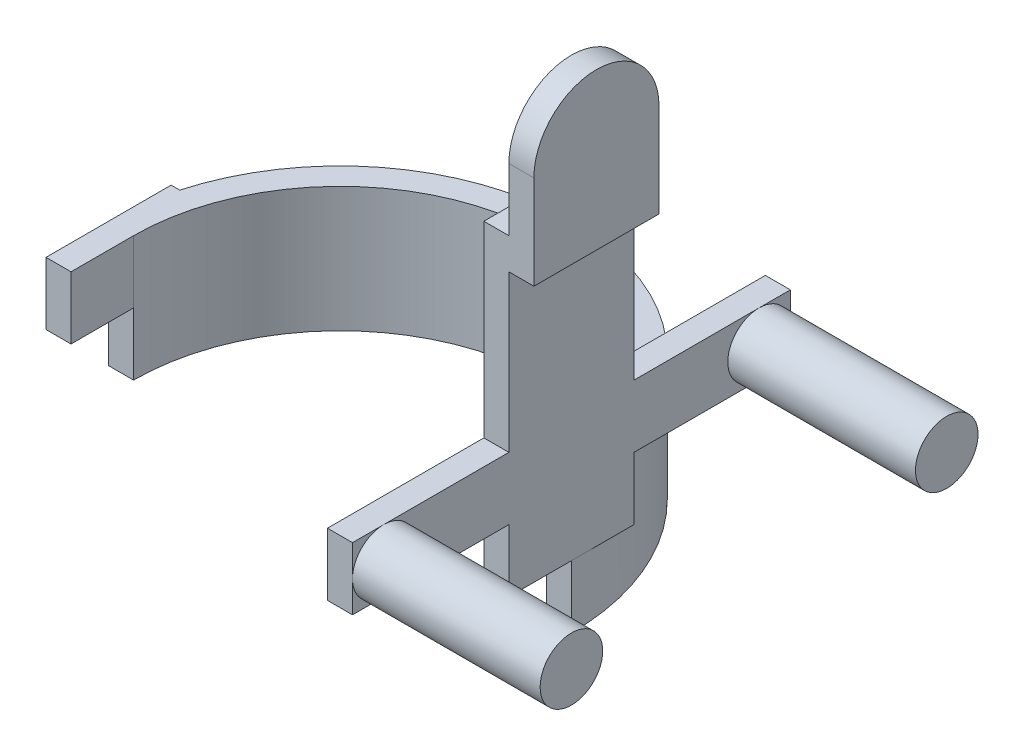
ISO-10303-21;
HEADER;
FILE_DESCRIPTION(('STEP AP214'),'2;1');
FILE_NAME('part.step','',(''),(''),'','','');
FILE_SCHEMA(('AUTOMOTIVE_DESIGN { 1 0 10303 214 1 1 1 1 }'));
ENDSEC;
DATA;
#1=APPLICATION_CONTEXT('core data for automotive mechanical design processes');
#2=APPLICATION_PROTOCOL_DEFINITION('international standard','automotive_design',2000,#1);
#3=PRODUCT_CONTEXT('',#1,'mechanical');
#4=PRODUCT('Part','Part','',(#3));
#5=PRODUCT_RELATED_PRODUCT_CATEGORY('part','',(#4));
#6=PRODUCT_DEFINITION_FORMATION('','',#4);
#7=PRODUCT_DEFINITION_CONTEXT('part definition',#1,'design');
#8=PRODUCT_DEFINITION('design','',#6,#7);
#9=PRODUCT_DEFINITION_SHAPE('','',#8);
#10=(LENGTH_UNIT() NAMED_UNIT(*) SI_UNIT(.MILLI.,.METRE.));
#11=(NAMED_UNIT(*) PLANE_ANGLE_UNIT() SI_UNIT($,.RADIAN.));
#12=(NAMED_UNIT(*) SI_UNIT($,.STERADIAN.) SOLID_ANGLE_UNIT());
#13=UNCERTAINTY_MEASURE_WITH_UNIT(LENGTH_MEASURE(1.E-05),#10,'distance_accuracy_value','');
#14=(GEOMETRIC_REPRESENTATION_CONTEXT(3) GLOBAL_UNCERTAINTY_ASSIGNED_CONTEXT((#13)) GLOBAL_UNIT_ASSIGNED_CONTEXT((#10,
#11,#12)) REPRESENTATION_CONTEXT('',''));
#15=CARTESIAN_POINT('',(0.,0.,0.));
#16=DIRECTION('',(0.,0.,1.));
#17=DIRECTION('',(1.,0.,0.));
#18=AXIS2_PLACEMENT_3D('',#15,#16,#17);
#19=CARTESIAN_POINT('',(74.,40.,-20.));
#20=DIRECTION('',(0.,0.,1.));
#21=DIRECTION('',(1.,0.,0.));
#22=AXIS2_PLACEMENT_3D('',#19,#20,#21);
#23=PLANE('',#22);
#24=DIRECTION('',(1.,0.,0.));
#25=VECTOR('',#24,1.);
#26=CARTESIAN_POINT('',(42.,140.,-20.));
#27=LINE('',#26,#25);
#28=CARTESIAN_POINT('',(74.,140.,-20.));
#29=VERTEX_POINT('',#28);
#30=CARTESIAN_POINT('',(82.,140.,-20.));
#31=VERTEX_POINT('',#30);
#32=EDGE_CURVE('E223',#29,#31,#27,.T.);
#33=ORIENTED_EDGE('',*,*,#32,.T.);
#34=DIRECTION('',(0.,-1.,0.));
#35=VECTOR('',#34,1.);
#36=CARTESIAN_POINT('',(82.,110.,-20.));
#37=LINE('',#36,#35);
#38=CARTESIAN_POINT('',(82.,110.,-20.));
#39=VERTEX_POINT('',#38);
#40=EDGE_CURVE('E234',#31,#39,#37,.T.);
#41=ORIENTED_EDGE('',*,*,#40,.T.);
#42=DIRECTION('',(-1.,0.,0.));
#43=VECTOR('',#42,1.);
#44=CARTESIAN_POINT('',(74.,110.,-20.));
#45=LINE('',#44,#43);
#46=CARTESIAN_POINT('',(74.,110.,-20.));
#47=VERTEX_POINT('',#46);
#48=EDGE_CURVE('E243',#39,#47,#45,.T.);
#49=ORIENTED_EDGE('',*,*,#48,.T.);
#50=DIRECTION('',(0.,-1.,0.));
#51=VECTOR('',#50,1.);
#52=CARTESIAN_POINT('',(74.,40.,-20.));
#53=LINE('',#52,#51);
#54=CARTESIAN_POINT('',(74.,60.,-20.));
#55=VERTEX_POINT('',#54);
#56=EDGE_CURVE('E423',#47,#55,#53,.T.);
#57=ORIENTED_EDGE('',*,*,#56,.T.);
#58=DIRECTION('',(-1.,0.,0.));
#59=VECTOR('',#58,1.);
#60=CARTESIAN_POINT('',(74.,60.,-20.));
#61=LINE('',#60,#59);
#62=CARTESIAN_POINT('',(66.,60.,-20.));
#63=VERTEX_POINT('',#62);
#64=EDGE_CURVE('E11',#55,#63,#61,.T.);
#65=ORIENTED_EDGE('',*,*,#64,.T.);
#66=DIRECTION('',(0.,-1.,0.));
#67=VECTOR('',#66,1.);
#68=CARTESIAN_POINT('',(66.,120.,-20.));
#69=LINE('',#68,#67);
#70=CARTESIAN_POINT('',(66.,120.,-20.));
#71=VERTEX_POINT('',#70);
#72=EDGE_CURVE('E388',#71,#63,#69,.T.);
#73=ORIENTED_EDGE('',*,*,#72,.F.);
#74=DIRECTION('',(-1.,0.,0.));
#75=VECTOR('',#74,1.);
#76=CARTESIAN_POINT('',(66.,120.,-20.));
#77=LINE('',#76,#75);
#78=CARTESIAN_POINT('',(74.,120.,-20.));
#79=VERTEX_POINT('',#78);
#80=EDGE_CURVE('E386',#79,#71,#77,.T.);
#81=ORIENTED_EDGE('',*,*,#80,.F.);
#82=DIRECTION('',(0.,1.,0.));
#83=VECTOR('',#82,1.);
#84=CARTESIAN_POINT('',(74.,110.,-20.));
#85=LINE('',#84,#83);
#86=EDGE_CURVE('E237',#79,#29,#85,.T.);
#87=ORIENTED_EDGE('',*,*,#86,.T.);
#88=EDGE_LOOP('',(#33,#41,#49,#57,#65,#73,#81,#87));
#89=FACE_BOUND('',#88,.T.);
#90=ADVANCED_FACE('F32',(#89),#23,.F.);
#91=CARTESIAN_POINT('',(74.,40.,-20.));
#92=DIRECTION('',(-1.,0.,0.));
#93=DIRECTION('',(0.,0.,1.));
#94=AXIS2_PLACEMENT_3D('',#91,#92,#93);
#95=PLANE('',#94);
#96=CARTESIAN_POINT('',(74.,50.,-60.));
#97=DIRECTION('',(1.,0.,0.));
#98=DIRECTION('',(0.,0.,-1.));
#99=AXIS2_PLACEMENT_3D('',#96,#97,#98);
#100=CIRCLE('',#99,9.99999999999999);
#101=CARTESIAN_POINT('',(74.,40.,-60.));
#102=VERTEX_POINT('',#101);
#103=CARTESIAN_POINT('',(74.,50.,-70.));
#104=VERTEX_POINT('',#103);
#105=EDGE_CURVE('E253',#102,#104,#100,.T.);
#106=ORIENTED_EDGE('',*,*,#105,.F.);
#107=DIRECTION('',(0.,0.,-1.));
#108=VECTOR('',#107,1.);
#109=CARTESIAN_POINT('',(74.,40.,-70.));
#110=LINE('',#109,#108);
#111=CARTESIAN_POINT('',(74.,40.,-70.));
#112=VERTEX_POINT('',#111);
#113=EDGE_CURVE('E295',#102,#112,#110,.T.);
#114=ORIENTED_EDGE('',*,*,#113,.T.);
#115=DIRECTION('',(0.,1.,0.));
#116=VECTOR('',#115,1.);
#117=CARTESIAN_POINT('',(74.,40.,-70.));
#118=LINE('',#117,#116);
#119=EDGE_CURVE('E284',#112,#104,#118,.T.);
#120=ORIENTED_EDGE('',*,*,#119,.T.);
#121=EDGE_LOOP('',(#106,#114,#120));
#122=FACE_BOUND('',#121,.T.);
#123=ADVANCED_FACE('F491',(#122),#95,.F.);
#124=CARTESIAN_POINT('',(74.,60.,-60.));
#125=VERTEX_POINT('',#124);
#126=EDGE_CURVE('E47',#104,#125,#100,.T.);
#127=ORIENTED_EDGE('',*,*,#126,.F.);
#128=CARTESIAN_POINT('',(74.,60.,-70.));
#129=VERTEX_POINT('',#128);
#130=EDGE_CURVE('E264',#104,#129,#118,.T.);
#131=ORIENTED_EDGE('',*,*,#130,.T.);
#132=DIRECTION('',(0.,0.,1.));
#133=VECTOR('',#132,1.);
#134=CARTESIAN_POINT('',(74.,60.,-70.));
#135=LINE('',#134,#133);
#136=EDGE_CURVE('E288',#129,#125,#135,.T.);
#137=ORIENTED_EDGE('',*,*,#136,.T.);
#138=EDGE_LOOP('',(#127,#131,#137));
#139=FACE_BOUND('',#138,.T.);
#140=ADVANCED_FACE('F516',(#139),#95,.F.);
#141=CARTESIAN_POINT('',(74.,50.,60.));
#142=DIRECTION('',(1.,0.,0.));
#143=DIRECTION('',(0.,0.,-1.));
#144=AXIS2_PLACEMENT_3D('',#141,#142,#143);
#145=CIRCLE('',#144,10.);
#146=CARTESIAN_POINT('',(74.,50.,70.));
#147=VERTEX_POINT('',#146);
#148=CARTESIAN_POINT('',(74.,40.,60.));
#149=VERTEX_POINT('',#148);
#150=EDGE_CURVE('E268',#147,#149,#145,.T.);
#151=ORIENTED_EDGE('',*,*,#150,.F.);
#152=DIRECTION('',(0.,-1.,0.));
#153=VECTOR('',#152,1.);
#154=CARTESIAN_POINT('',(74.,40.,70.));
#155=LINE('',#154,#153);
#156=CARTESIAN_POINT('',(74.,40.,70.));
#157=VERTEX_POINT('',#156);
#158=EDGE_CURVE('E290',#147,#157,#155,.T.);
#159=ORIENTED_EDGE('',*,*,#158,.T.);
#160=EDGE_CURVE('E273',#157,#149,#110,.T.);
#161=ORIENTED_EDGE('',*,*,#160,.T.);
#162=EDGE_LOOP('',(#151,#159,#161));
#163=FACE_BOUND('',#162,.T.);
#164=ADVANCED_FACE('F849',(#163),#95,.F.);
#165=ORIENTED_EDGE('',*,*,#56,.F.);
#166=DIRECTION('',(0.,0.,-1.));
#167=VECTOR('',#166,1.);
#168=CARTESIAN_POINT('',(74.,110.,20.));
#169=LINE('',#168,#167);
#170=CARTESIAN_POINT('',(74.,110.,20.));
#171=VERTEX_POINT('',#170);
#172=EDGE_CURVE('E251',#171,#47,#169,.T.);
#173=ORIENTED_EDGE('',*,*,#172,.F.);
#174=DIRECTION('',(0.,-1.,0.));
#175=VECTOR('',#174,1.);
#176=CARTESIAN_POINT('',(74.,40.,20.));
#177=LINE('',#176,#175);
#178=CARTESIAN_POINT('',(74.,60.,20.));
#179=VERTEX_POINT('',#178);
#180=EDGE_CURVE('E426',#171,#179,#177,.T.);
#181=ORIENTED_EDGE('',*,*,#180,.T.);
#182=CARTESIAN_POINT('',(74.,60.,60.));
#183=VERTEX_POINT('',#182);
#184=EDGE_CURVE('E292',#179,#183,#135,.T.);
#185=ORIENTED_EDGE('',*,*,#184,.T.);
#186=EDGE_CURVE('E259',#149,#183,#145,.T.);
#187=ORIENTED_EDGE('',*,*,#186,.F.);
#188=CARTESIAN_POINT('',(74.,40.,20.));
#189=VERTEX_POINT('',#188);
#190=EDGE_CURVE('E298',#149,#189,#110,.T.);
#191=ORIENTED_EDGE('',*,*,#190,.T.);
#192=CARTESIAN_POINT('',(74.,20.,20.));
#193=VERTEX_POINT('',#192);
#194=EDGE_CURVE('E425',#189,#193,#177,.T.);
#195=ORIENTED_EDGE('',*,*,#194,.T.);
#196=DIRECTION('',(0.,0.,1.));
#197=VECTOR('',#196,1.);
#198=CARTESIAN_POINT('',(74.,20.,-20.));
#199=LINE('',#198,#197);
#200=CARTESIAN_POINT('',(74.,20.,0.));
#201=VERTEX_POINT('',#200);
#202=EDGE_CURVE('E368',#201,#193,#199,.T.);
#203=ORIENTED_EDGE('',*,*,#202,.F.);
#204=CARTESIAN_POINT('',(74.,20.,-20.));
#205=VERTEX_POINT('',#204);
#206=EDGE_CURVE('E366',#205,#201,#199,.T.);
#207=ORIENTED_EDGE('',*,*,#206,.F.);
#208=CARTESIAN_POINT('',(74.,40.,-20.));
#209=VERTEX_POINT('',#208);
#210=EDGE_CURVE('E422',#209,#205,#53,.T.);
#211=ORIENTED_EDGE('',*,*,#210,.F.);
#212=EDGE_CURVE('E299',#209,#102,#110,.T.);
#213=ORIENTED_EDGE('',*,*,#212,.T.);
#214=EDGE_CURVE('E55',#125,#102,#100,.T.);
#215=ORIENTED_EDGE('',*,*,#214,.F.);
#216=EDGE_CURVE('E291',#125,#55,#135,.T.);
#217=ORIENTED_EDGE('',*,*,#216,.T.);
#218=EDGE_LOOP('',(#165,#173,#181,#185,#187,#191,#195,#203,#207,#211,#213,#215,#217));
#219=FACE_BOUND('',#218,.T.);
#220=ADVANCED_FACE('F528',(#219),#95,.F.);
#221=CARTESIAN_POINT('',(74.,40.,20.));
#222=DIRECTION('',(0.,0.,-1.));
#223=DIRECTION('',(-1.,0.,0.));
#224=AXIS2_PLACEMENT_3D('',#221,#222,#223);
#225=PLANE('',#224);
#226=ORIENTED_EDGE('',*,*,#194,.F.);
#227=DIRECTION('',(-1.,0.,0.));
#228=VECTOR('',#227,1.);
#229=CARTESIAN_POINT('',(74.,40.,20.));
#230=LINE('',#229,#228);
#231=CARTESIAN_POINT('',(66.,40.,20.));
#232=VERTEX_POINT('',#231);
#233=EDGE_CURVE('E313',#189,#232,#230,.T.);
#234=ORIENTED_EDGE('',*,*,#233,.T.);
#235=DIRECTION('',(0.,-1.,0.));
#236=VECTOR('',#235,1.);
#237=CARTESIAN_POINT('',(66.,40.,20.));
#238=LINE('',#237,#236);
#239=CARTESIAN_POINT('',(66.,20.,20.));
#240=VERTEX_POINT('',#239);
#241=EDGE_CURVE('E428',#232,#240,#238,.T.);
#242=ORIENTED_EDGE('',*,*,#241,.T.);
#243=DIRECTION('',(1.,0.,0.));
#244=VECTOR('',#243,1.);
#245=CARTESIAN_POINT('',(71.2460525222275,20.,20.));
#246=LINE('',#245,#244);
#247=EDGE_CURVE('E340',#240,#193,#246,.T.);
#248=ORIENTED_EDGE('',*,*,#247,.T.);
#249=EDGE_LOOP('',(#226,#234,#242,#248));
#250=FACE_BOUND('',#249,.T.);
#251=ADVANCED_FACE('F521',(#250),#225,.F.);
#252=DIRECTION('',(0.,-1.,0.));
#253=VECTOR('',#252,1.);
#254=CARTESIAN_POINT('',(71.2460525222275,40.,-20.));
#255=LINE('',#254,#253);
#256=CARTESIAN_POINT('',(71.2460525222275,40.,-20.));
#257=VERTEX_POINT('',#256);
#258=CARTESIAN_POINT('',(71.2460525222275,20.,-20.));
#259=VERTEX_POINT('',#258);
#260=EDGE_CURVE('E419',#257,#259,#255,.T.);
#261=ORIENTED_EDGE('',*,*,#260,.F.);
#262=DIRECTION('',(1.,0.,0.));
#263=VECTOR('',#262,1.);
#264=CARTESIAN_POINT('',(74.,40.,-20.));
#265=LINE('',#264,#263);
#266=EDGE_CURVE('E303',#257,#209,#265,.T.);
#267=ORIENTED_EDGE('',*,*,#266,.T.);
#268=ORIENTED_EDGE('',*,*,#210,.T.);
#269=DIRECTION('',(1.,0.,0.));
#270=VECTOR('',#269,1.);
#271=CARTESIAN_POINT('',(74.,20.,-20.));
#272=LINE('',#271,#270);
#273=EDGE_CURVE('E363',#259,#205,#272,.T.);
#274=ORIENTED_EDGE('',*,*,#273,.F.);
#275=EDGE_LOOP('',(#261,#267,#268,#274));
#276=FACE_BOUND('',#275,.T.);
#277=ADVANCED_FACE('F512',(#276),#23,.F.);
#278=CARTESIAN_POINT('',(0.,40.,0.));
#279=DIRECTION('',(0.,1.,0.));
#280=DIRECTION('',(0.,0.,1.));
#281=AXIS2_PLACEMENT_3D('',#278,#279,#280);
#282=PLANE('',#281);
#283=DIRECTION('',(0.,0.,1.));
#284=VECTOR('',#283,1.);
#285=CARTESIAN_POINT('',(66.,40.,20.));
#286=LINE('',#285,#284);
#287=CARTESIAN_POINT('',(66.,40.,-33.466401061363));
#288=VERTEX_POINT('',#287);
#289=CARTESIAN_POINT('',(66.,40.,0.));
#290=VERTEX_POINT('',#289);
#291=EDGE_CURVE('E376',#288,#290,#286,.T.);
#292=ORIENTED_EDGE('',*,*,#291,.F.);
#293=CARTESIAN_POINT('',(0.,40.,0.));
#294=DIRECTION('',(0.,1.,0.));
#295=DIRECTION('',(0.,0.,1.));
#296=AXIS2_PLACEMENT_3D('',#293,#294,#295);
#297=CIRCLE('',#296,74.);
#298=CARTESIAN_POINT('',(-71.2460525222275,40.,-20.));
#299=VERTEX_POINT('',#298);
#300=EDGE_CURVE('E396',#288,#299,#297,.T.);
#301=ORIENTED_EDGE('',*,*,#300,.T.);
#302=DIRECTION('',(-1.,0.,0.));
#303=VECTOR('',#302,1.);
#304=CARTESIAN_POINT('',(-64.,40.,-20.));
#305=LINE('',#304,#303);
#306=CARTESIAN_POINT('',(-74.,40.,-20.));
#307=VERTEX_POINT('',#306);
#308=EDGE_CURVE('E371',#299,#307,#305,.T.);
#309=ORIENTED_EDGE('',*,*,#308,.T.);
#310=DIRECTION('',(0.,0.,1.));
#311=VECTOR('',#310,1.);
#312=CARTESIAN_POINT('',(-74.,40.,-20.));
#313=LINE('',#312,#311);
#314=CARTESIAN_POINT('',(-74.,40.,20.));
#315=VERTEX_POINT('',#314);
#316=EDGE_CURVE('E369',#307,#315,#313,.T.);
#317=ORIENTED_EDGE('',*,*,#316,.T.);
#318=DIRECTION('',(-1.,0.,0.));
#319=VECTOR('',#318,1.);
#320=CARTESIAN_POINT('',(-74.,40.,20.));
#321=LINE('',#320,#319);
#322=CARTESIAN_POINT('',(-66.,40.,20.));
#323=VERTEX_POINT('',#322);
#324=EDGE_CURVE('E373',#323,#315,#321,.T.);
#325=ORIENTED_EDGE('',*,*,#324,.F.);
#326=DIRECTION('',(0.,0.,1.));
#327=VECTOR('',#326,1.);
#328=CARTESIAN_POINT('',(-66.,40.,0.));
#329=LINE('',#328,#327);
#330=CARTESIAN_POINT('',(-66.,40.,0.));
#331=VERTEX_POINT('',#330);
#332=EDGE_CURVE('E40',#331,#323,#329,.T.);
#333=ORIENTED_EDGE('',*,*,#332,.F.);
#334=CARTESIAN_POINT('',(0.,40.,0.));
#335=DIRECTION('',(0.,-1.,0.));
#336=DIRECTION('',(0.,0.,1.));
#337=AXIS2_PLACEMENT_3D('',#334,#335,#336);
#338=CIRCLE('',#337,66.);
#339=EDGE_CURVE('E394',#331,#290,#338,.T.);
#340=ORIENTED_EDGE('',*,*,#339,.T.);
#341=EDGE_LOOP('',(#292,#301,#309,#317,#325,#333,#340));
#342=FACE_BOUND('',#341,.T.);
#343=ADVANCED_FACE('F474',(#342),#282,.T.);
#344=CARTESIAN_POINT('',(66.,40.,0.));
#345=DIRECTION('',(1.,0.,0.));
#346=DIRECTION('',(0.,0.,-1.));
#347=AXIS2_PLACEMENT_3D('',#344,#345,#346);
#348=PLANE('',#347);
#349=ORIENTED_EDGE('',*,*,#72,.T.);
#350=DIRECTION('',(0.,0.,1.));
#351=VECTOR('',#350,1.);
#352=CARTESIAN_POINT('',(66.,60.,-70.));
#353=LINE('',#352,#351);
#354=CARTESIAN_POINT('',(66.,60.,-70.));
#355=VERTEX_POINT('',#354);
#356=EDGE_CURVE('E274',#355,#63,#353,.T.);
#357=ORIENTED_EDGE('',*,*,#356,.F.);
#358=DIRECTION('',(0.,1.,0.));
#359=VECTOR('',#358,1.);
#360=CARTESIAN_POINT('',(66.,40.,-70.));
#361=LINE('',#360,#359);
#362=CARTESIAN_POINT('',(66.,40.,-70.));
#363=VERTEX_POINT('',#362);
#364=EDGE_CURVE('E269',#363,#355,#361,.T.);
#365=ORIENTED_EDGE('',*,*,#364,.F.);
#366=DIRECTION('',(0.,0.,-1.));
#367=VECTOR('',#366,1.);
#368=CARTESIAN_POINT('',(66.,40.,-70.));
#369=LINE('',#368,#367);
#370=EDGE_CURVE('E280',#288,#363,#369,.T.);
#371=ORIENTED_EDGE('',*,*,#370,.F.);
#372=ORIENTED_EDGE('',*,*,#291,.T.);
#373=DIRECTION('',(0.,-1.,0.));
#374=VECTOR('',#373,1.);
#375=CARTESIAN_POINT('',(66.,40.,0.));
#376=LINE('',#375,#374);
#377=CARTESIAN_POINT('',(66.,20.,0.));
#378=VERTEX_POINT('',#377);
#379=EDGE_CURVE('E432',#290,#378,#376,.T.);
#380=ORIENTED_EDGE('',*,*,#379,.T.);
#381=DIRECTION('',(0.,0.,1.));
#382=VECTOR('',#381,1.);
#383=CARTESIAN_POINT('',(66.,20.,20.));
#384=LINE('',#383,#382);
#385=EDGE_CURVE('E337',#378,#240,#384,.T.);
#386=ORIENTED_EDGE('',*,*,#385,.T.);
#387=ORIENTED_EDGE('',*,*,#241,.F.);
#388=CARTESIAN_POINT('',(66.,40.,70.));
#389=VERTEX_POINT('',#388);
#390=EDGE_CURVE('E281',#389,#232,#369,.T.);
#391=ORIENTED_EDGE('',*,*,#390,.F.);
#392=DIRECTION('',(0.,-1.,0.));
#393=VECTOR('',#392,1.);
#394=CARTESIAN_POINT('',(66.,40.,70.));
#395=LINE('',#394,#393);
#396=CARTESIAN_POINT('',(66.,60.,70.));
#397=VERTEX_POINT('',#396);
#398=EDGE_CURVE('E277',#397,#389,#395,.T.);
#399=ORIENTED_EDGE('',*,*,#398,.F.);
#400=CARTESIAN_POINT('',(66.,60.,20.));
#401=VERTEX_POINT('',#400);
#402=EDGE_CURVE('E272',#401,#397,#353,.T.);
#403=ORIENTED_EDGE('',*,*,#402,.F.);
#404=CARTESIAN_POINT('',(66.,120.,20.));
#405=VERTEX_POINT('',#404);
#406=EDGE_CURVE('E429',#405,#401,#238,.T.);
#407=ORIENTED_EDGE('',*,*,#406,.F.);
#408=DIRECTION('',(0.,0.,1.));
#409=VECTOR('',#408,1.);
#410=CARTESIAN_POINT('',(66.,120.,20.));
#411=LINE('',#410,#409);
#412=EDGE_CURVE('E377',#71,#405,#411,.T.);
#413=ORIENTED_EDGE('',*,*,#412,.F.);
#414=EDGE_LOOP('',(#349,#357,#365,#371,#372,#380,#386,#387,#391,#399,#403,#407,#413));
#415=FACE_BOUND('',#414,.T.);
#416=ADVANCED_FACE('F477',(#415),#348,.F.);
#417=DIRECTION('',(0.,-1.,0.));
#418=VECTOR('',#417,1.);
#419=CARTESIAN_POINT('',(82.,110.,20.));
#420=LINE('',#419,#418);
#421=CARTESIAN_POINT('',(82.,140.,20.));
#422=VERTEX_POINT('',#421);
#423=CARTESIAN_POINT('',(82.,110.,20.));
#424=VERTEX_POINT('',#423);
#425=EDGE_CURVE('E899',#422,#424,#420,.T.);
#426=ORIENTED_EDGE('',*,*,#425,.F.);
#427=DIRECTION('',(1.,0.,0.));
#428=VECTOR('',#427,1.);
#429=CARTESIAN_POINT('',(42.,140.,20.));
#430=LINE('',#429,#428);
#431=CARTESIAN_POINT('',(74.,140.,20.));
#432=VERTEX_POINT('',#431);
#433=EDGE_CURVE('E226',#432,#422,#430,.T.);
#434=ORIENTED_EDGE('',*,*,#433,.F.);
#435=DIRECTION('',(0.,1.,0.));
#436=VECTOR('',#435,1.);
#437=CARTESIAN_POINT('',(74.,110.,20.));
#438=LINE('',#437,#436);
#439=CARTESIAN_POINT('',(74.,120.,20.));
#440=VERTEX_POINT('',#439);
#441=EDGE_CURVE('E245',#440,#432,#438,.T.);
#442=ORIENTED_EDGE('',*,*,#441,.F.);
#443=DIRECTION('',(1.,0.,0.));
#444=VECTOR('',#443,1.);
#445=CARTESIAN_POINT('',(66.,120.,20.));
#446=LINE('',#445,#444);
#447=EDGE_CURVE('E380',#405,#440,#446,.T.);
#448=ORIENTED_EDGE('',*,*,#447,.F.);
#449=ORIENTED_EDGE('',*,*,#406,.T.);
#450=DIRECTION('',(1.,0.,0.));
#451=VECTOR('',#450,1.);
#452=CARTESIAN_POINT('',(74.,60.,20.));
#453=LINE('',#452,#451);
#454=EDGE_CURVE('E316',#401,#179,#453,.T.);
#455=ORIENTED_EDGE('',*,*,#454,.T.);
#456=ORIENTED_EDGE('',*,*,#180,.F.);
#457=DIRECTION('',(-1.,0.,0.));
#458=VECTOR('',#457,1.);
#459=CARTESIAN_POINT('',(74.,110.,20.));
#460=LINE('',#459,#458);
#461=EDGE_CURVE('E255',#424,#171,#460,.T.);
#462=ORIENTED_EDGE('',*,*,#461,.F.);
#463=EDGE_LOOP('',(#426,#434,#442,#448,#449,#455,#456,#462));
#464=FACE_BOUND('',#463,.T.);
#465=ADVANCED_FACE('F531',(#464),#225,.F.);
#466=EDGE_CURVE('E265',#183,#147,#145,.T.);
#467=ORIENTED_EDGE('',*,*,#466,.F.);
#468=CARTESIAN_POINT('',(74.,60.,70.));
#469=VERTEX_POINT('',#468);
#470=EDGE_CURVE('E287',#183,#469,#135,.T.);
#471=ORIENTED_EDGE('',*,*,#470,.T.);
#472=EDGE_CURVE('E293',#469,#147,#155,.T.);
#473=ORIENTED_EDGE('',*,*,#472,.T.);
#474=EDGE_LOOP('',(#467,#471,#473));
#475=FACE_BOUND('',#474,.T.);
#476=ADVANCED_FACE('F518',(#475),#95,.F.);
#477=CARTESIAN_POINT('',(-74.,40.,-20.));
#478=DIRECTION('',(0.,0.,1.));
#479=DIRECTION('',(1.,0.,0.));
#480=AXIS2_PLACEMENT_3D('',#477,#478,#479);
#481=PLANE('',#480);
#482=DIRECTION('',(1.,0.,0.));
#483=VECTOR('',#482,1.);
#484=CARTESIAN_POINT('',(-74.,20.,-20.));
#485=LINE('',#484,#483);
#486=CARTESIAN_POINT('',(-74.,20.,-20.));
#487=VERTEX_POINT('',#486);
#488=CARTESIAN_POINT('',(-71.2460525222275,20.,-20.));
#489=VERTEX_POINT('',#488);
#490=EDGE_CURVE('E361',#487,#489,#485,.T.);
#491=ORIENTED_EDGE('',*,*,#490,.F.);
#492=DIRECTION('',(0.,-1.,0.));
#493=VECTOR('',#492,1.);
#494=CARTESIAN_POINT('',(-74.,40.,-20.));
#495=LINE('',#494,#493);
#496=EDGE_CURVE('E413',#307,#487,#495,.T.);
#497=ORIENTED_EDGE('',*,*,#496,.F.);
#498=ORIENTED_EDGE('',*,*,#308,.F.);
#499=DIRECTION('',(0.,-1.,0.));
#500=VECTOR('',#499,1.);
#501=CARTESIAN_POINT('',(-71.2460525222275,40.,-20.));
#502=LINE('',#501,#500);
#503=EDGE_CURVE('E416',#299,#489,#502,.T.);
#504=ORIENTED_EDGE('',*,*,#503,.T.);
#505=EDGE_LOOP('',(#491,#497,#498,#504));
#506=FACE_BOUND('',#505,.T.);
#507=ADVANCED_FACE('F459',(#506),#481,.F.);
#508=CARTESIAN_POINT('',(-74.,40.,-20.));
#509=DIRECTION('',(1.,0.,0.));
#510=DIRECTION('',(0.,0.,-1.));
#511=AXIS2_PLACEMENT_3D('',#508,#509,#510);
#512=PLANE('',#511);
#513=DIRECTION('',(0.,0.,-1.));
#514=VECTOR('',#513,1.);
#515=CARTESIAN_POINT('',(-74.,20.,-20.));
#516=LINE('',#515,#514);
#517=CARTESIAN_POINT('',(-74.,20.,20.));
#518=VERTEX_POINT('',#517);
#519=CARTESIAN_POINT('',(-74.,20.,0.));
#520=VERTEX_POINT('',#519);
#521=EDGE_CURVE('E350',#518,#520,#516,.T.);
#522=ORIENTED_EDGE('',*,*,#521,.F.);
#523=DIRECTION('',(0.,-1.,0.));
#524=VECTOR('',#523,1.);
#525=CARTESIAN_POINT('',(-74.,40.,20.));
#526=LINE('',#525,#524);
#527=EDGE_CURVE('E410',#315,#518,#526,.T.);
#528=ORIENTED_EDGE('',*,*,#527,.F.);
#529=ORIENTED_EDGE('',*,*,#316,.F.);
#530=ORIENTED_EDGE('',*,*,#496,.T.);
#531=EDGE_CURVE('E360',#520,#487,#516,.T.);
#532=ORIENTED_EDGE('',*,*,#531,.F.);
#533=EDGE_LOOP('',(#522,#528,#529,#530,#532));
#534=FACE_BOUND('',#533,.T.);
#535=ADVANCED_FACE('F451',(#534),#512,.F.);
#536=CARTESIAN_POINT('',(-74.,40.,20.));
#537=DIRECTION('',(0.,0.,-1.));
#538=DIRECTION('',(-1.,0.,0.));
#539=AXIS2_PLACEMENT_3D('',#536,#537,#538);
#540=PLANE('',#539);
#541=DIRECTION('',(1.,0.,0.));
#542=VECTOR('',#541,1.);
#543=CARTESIAN_POINT('',(-71.2460525222275,20.,20.));
#544=LINE('',#543,#542);
#545=CARTESIAN_POINT('',(-66.,20.,20.));
#546=VERTEX_POINT('',#545);
#547=EDGE_CURVE('E320',#518,#546,#544,.T.);
#548=ORIENTED_EDGE('',*,*,#547,.T.);
#549=DIRECTION('',(0.,-1.,0.));
#550=VECTOR('',#549,1.);
#551=CARTESIAN_POINT('',(-66.,40.,20.));
#552=LINE('',#551,#550);
#553=EDGE_CURVE('E407',#323,#546,#552,.T.);
#554=ORIENTED_EDGE('',*,*,#553,.F.);
#555=ORIENTED_EDGE('',*,*,#324,.T.);
#556=ORIENTED_EDGE('',*,*,#527,.T.);
#557=EDGE_LOOP('',(#548,#554,#555,#556));
#558=FACE_BOUND('',#557,.T.);
#559=ADVANCED_FACE('F442',(#558),#540,.F.);
#560=CARTESIAN_POINT('',(-66.,40.,0.));
#561=DIRECTION('',(-1.,0.,0.));
#562=DIRECTION('',(0.,0.,1.));
#563=AXIS2_PLACEMENT_3D('',#560,#561,#562);
#564=PLANE('',#563);
#565=DIRECTION('',(0.,0.,-1.));
#566=VECTOR('',#565,1.);
#567=CARTESIAN_POINT('',(-66.,20.,20.));
#568=LINE('',#567,#566);
#569=CARTESIAN_POINT('',(-66.,20.,0.));
#570=VERTEX_POINT('',#569);
#571=EDGE_CURVE('E323',#546,#570,#568,.T.);
#572=ORIENTED_EDGE('',*,*,#571,.T.);
#573=DIRECTION('',(0.,-1.,0.));
#574=VECTOR('',#573,1.);
#575=CARTESIAN_POINT('',(-66.,40.,0.));
#576=LINE('',#575,#574);
#577=EDGE_CURVE('E401',#331,#570,#576,.T.);
#578=ORIENTED_EDGE('',*,*,#577,.F.);
#579=ORIENTED_EDGE('',*,*,#332,.T.);
#580=ORIENTED_EDGE('',*,*,#553,.T.);
#581=EDGE_LOOP('',(#572,#578,#579,#580));
#582=FACE_BOUND('',#581,.T.);
#583=ADVANCED_FACE('F438',(#582),#564,.F.);
#584=CARTESIAN_POINT('',(0.,0.,0.));
#585=DIRECTION('',(0.,1.,0.));
#586=DIRECTION('',(0.,0.,1.));
#587=AXIS2_PLACEMENT_3D('',#584,#585,#586);
#588=PLANE('',#587);
#589=DIRECTION('',(-1.,0.,0.));
#590=VECTOR('',#589,1.);
#591=CARTESIAN_POINT('',(74.,0.,0.));
#592=LINE('',#591,#590);
#593=CARTESIAN_POINT('',(74.,0.,0.));
#594=VERTEX_POINT('',#593);
#595=CARTESIAN_POINT('',(66.,0.,0.));
#596=VERTEX_POINT('',#595);
#597=EDGE_CURVE('E324',#594,#596,#592,.T.);
#598=ORIENTED_EDGE('',*,*,#597,.T.);
#599=CARTESIAN_POINT('',(0.,0.,0.));
#600=DIRECTION('',(0.,-1.,0.));
#601=DIRECTION('',(0.,0.,1.));
#602=AXIS2_PLACEMENT_3D('',#599,#600,#601);
#603=CIRCLE('',#602,66.);
#604=CARTESIAN_POINT('',(-66.,0.,0.));
#605=VERTEX_POINT('',#604);
#606=EDGE_CURVE('E393',#605,#596,#603,.T.);
#607=ORIENTED_EDGE('',*,*,#606,.F.);
#608=DIRECTION('',(-1.,0.,0.));
#609=VECTOR('',#608,1.);
#610=CARTESIAN_POINT('',(-74.,0.,0.));
#611=LINE('',#610,#609);
#612=CARTESIAN_POINT('',(-74.,0.,0.));
#613=VERTEX_POINT('',#612);
#614=EDGE_CURVE('E319',#605,#613,#611,.T.);
#615=ORIENTED_EDGE('',*,*,#614,.T.);
#616=CARTESIAN_POINT('',(0.,0.,0.));
#617=DIRECTION('',(0.,1.,0.));
#618=DIRECTION('',(0.,0.,1.));
#619=AXIS2_PLACEMENT_3D('',#616,#617,#618);
#620=CIRCLE('',#619,74.);
#621=EDGE_CURVE('E397',#594,#613,#620,.T.);
#622=ORIENTED_EDGE('',*,*,#621,.F.);
#623=EDGE_LOOP('',(#598,#607,#615,#622));
#624=FACE_BOUND('',#623,.T.);
#625=ADVANCED_FACE('F469',(#624),#588,.F.);
#626=CARTESIAN_POINT('',(0.,40.,0.));
#627=DIRECTION('',(0.,-1.,0.));
#628=DIRECTION('',(0.,0.,-1.));
#629=AXIS2_PLACEMENT_3D('',#626,#627,#628);
#630=CYLINDRICAL_SURFACE('',#629,66.);
#631=ORIENTED_EDGE('',*,*,#606,.T.);
#632=DIRECTION('',(0.,-1.,0.));
#633=VECTOR('',#632,1.);
#634=CARTESIAN_POINT('',(66.,20.,0.));
#635=LINE('',#634,#633);
#636=EDGE_CURVE('E348',#378,#596,#635,.T.);
#637=ORIENTED_EDGE('',*,*,#636,.F.);
#638=ORIENTED_EDGE('',*,*,#379,.F.);
#639=ORIENTED_EDGE('',*,*,#339,.F.);
#640=ORIENTED_EDGE('',*,*,#577,.T.);
#641=DIRECTION('',(0.,-1.,0.));
#642=VECTOR('',#641,1.);
#643=CARTESIAN_POINT('',(-66.,20.,0.));
#644=LINE('',#643,#642);
#645=EDGE_CURVE('E343',#570,#605,#644,.T.);
#646=ORIENTED_EDGE('',*,*,#645,.T.);
#647=EDGE_LOOP('',(#631,#637,#638,#639,#640,#646));
#648=FACE_BOUND('',#647,.T.);
#649=ADVANCED_FACE('F34',(#648),#630,.F.);
#650=CARTESIAN_POINT('',(0.,40.,0.));
#651=DIRECTION('',(0.,-1.,0.));
#652=DIRECTION('',(0.,0.,-1.));
#653=AXIS2_PLACEMENT_3D('',#650,#651,#652);
#654=CYLINDRICAL_SURFACE('',#653,74.);
#655=ORIENTED_EDGE('',*,*,#621,.T.);
#656=DIRECTION('',(0.,-1.,0.));
#657=VECTOR('',#656,1.);
#658=CARTESIAN_POINT('',(-74.,20.,0.));
#659=LINE('',#658,#657);
#660=EDGE_CURVE('E354',#520,#613,#659,.T.);
#661=ORIENTED_EDGE('',*,*,#660,.F.);
#662=CARTESIAN_POINT('',(0.,20.,0.));
#663=DIRECTION('',(0.,-1.,0.));
#664=DIRECTION('',(0.,0.,-1.));
#665=AXIS2_PLACEMENT_3D('',#662,#663,#664);
#666=CIRCLE('',#665,74.);
#667=EDGE_CURVE('E331',#520,#489,#666,.T.);
#668=ORIENTED_EDGE('',*,*,#667,.T.);
#669=ORIENTED_EDGE('',*,*,#503,.F.);
#670=ORIENTED_EDGE('',*,*,#300,.F.);
#671=EDGE_CURVE('E398',#257,#288,#297,.T.);
#672=ORIENTED_EDGE('',*,*,#671,.F.);
#673=ORIENTED_EDGE('',*,*,#260,.T.);
#674=EDGE_CURVE('E330',#259,#201,#666,.T.);
#675=ORIENTED_EDGE('',*,*,#674,.T.);
#676=DIRECTION('',(0.,-1.,0.));
#677=VECTOR('',#676,1.);
#678=CARTESIAN_POINT('',(74.,20.,0.));
#679=LINE('',#678,#677);
#680=EDGE_CURVE('E351',#201,#594,#679,.T.);
#681=ORIENTED_EDGE('',*,*,#680,.T.);
#682=EDGE_LOOP('',(#655,#661,#668,#669,#670,#672,#673,#675,#681));
#683=FACE_BOUND('',#682,.T.);
#684=ADVANCED_FACE('F464',(#683),#654,.T.);
#685=CARTESIAN_POINT('',(0.,120.,0.));
#686=DIRECTION('',(0.,-1.,0.));
#687=DIRECTION('',(0.,0.,-1.));
#688=AXIS2_PLACEMENT_3D('',#685,#686,#687);
#689=PLANE('',#688);
#690=ORIENTED_EDGE('',*,*,#412,.T.);
#691=ORIENTED_EDGE('',*,*,#447,.T.);
#692=DIRECTION('',(0.,0.,-1.));
#693=VECTOR('',#692,1.);
#694=CARTESIAN_POINT('',(74.,120.,20.));
#695=LINE('',#694,#693);
#696=EDGE_CURVE('E383',#440,#79,#695,.T.);
#697=ORIENTED_EDGE('',*,*,#696,.T.);
#698=ORIENTED_EDGE('',*,*,#80,.T.);
#699=EDGE_LOOP('',(#690,#691,#697,#698));
#700=FACE_BOUND('',#699,.T.);
#701=ADVANCED_FACE('F571',(#700),#689,.F.);
#702=CARTESIAN_POINT('',(-74.,20.,0.));
#703=DIRECTION('',(0.,0.,1.));
#704=DIRECTION('',(1.,0.,0.));
#705=AXIS2_PLACEMENT_3D('',#702,#703,#704);
#706=PLANE('',#705);
#707=ORIENTED_EDGE('',*,*,#614,.F.);
#708=ORIENTED_EDGE('',*,*,#645,.F.);
#709=DIRECTION('',(-1.,0.,0.));
#710=VECTOR('',#709,1.);
#711=CARTESIAN_POINT('',(-74.,20.,0.));
#712=LINE('',#711,#710);
#713=EDGE_CURVE('E327',#570,#520,#712,.T.);
#714=ORIENTED_EDGE('',*,*,#713,.T.);
#715=ORIENTED_EDGE('',*,*,#660,.T.);
#716=EDGE_LOOP('',(#707,#708,#714,#715));
#717=FACE_BOUND('',#716,.T.);
#718=ADVANCED_FACE('F466',(#717),#706,.T.);
#719=CARTESIAN_POINT('',(0.,20.,0.));
#720=DIRECTION('',(0.,-1.,0.));
#721=DIRECTION('',(0.,0.,-1.));
#722=AXIS2_PLACEMENT_3D('',#719,#720,#721);
#723=PLANE('',#722);
#724=ORIENTED_EDGE('',*,*,#521,.T.);
#725=ORIENTED_EDGE('',*,*,#713,.F.);
#726=ORIENTED_EDGE('',*,*,#571,.F.);
#727=ORIENTED_EDGE('',*,*,#547,.F.);
#728=EDGE_LOOP('',(#724,#725,#726,#727));
#729=FACE_BOUND('',#728,.T.);
#730=ADVANCED_FACE('F446',(#729),#723,.T.);
#731=ORIENTED_EDGE('',*,*,#490,.T.);
#732=ORIENTED_EDGE('',*,*,#667,.F.);
#733=ORIENTED_EDGE('',*,*,#531,.T.);
#734=EDGE_LOOP('',(#731,#732,#733));
#735=FACE_BOUND('',#734,.T.);
#736=ADVANCED_FACE('F457',(#735),#723,.T.);
#737=ORIENTED_EDGE('',*,*,#202,.T.);
#738=ORIENTED_EDGE('',*,*,#247,.F.);
#739=ORIENTED_EDGE('',*,*,#385,.F.);
#740=DIRECTION('',(-1.,0.,0.));
#741=VECTOR('',#740,1.);
#742=CARTESIAN_POINT('',(74.,20.,0.));
#743=LINE('',#742,#741);
#744=EDGE_CURVE('E334',#201,#378,#743,.T.);
#745=ORIENTED_EDGE('',*,*,#744,.F.);
#746=EDGE_LOOP('',(#737,#738,#739,#745));
#747=FACE_BOUND('',#746,.T.);
#748=ADVANCED_FACE('F553',(#747),#723,.T.);
#749=ORIENTED_EDGE('',*,*,#206,.T.);
#750=ORIENTED_EDGE('',*,*,#674,.F.);
#751=ORIENTED_EDGE('',*,*,#273,.T.);
#752=EDGE_LOOP('',(#749,#750,#751));
#753=FACE_BOUND('',#752,.T.);
#754=ADVANCED_FACE('F556',(#753),#723,.T.);
#755=CARTESIAN_POINT('',(74.,20.,0.));
#756=DIRECTION('',(0.,0.,1.));
#757=DIRECTION('',(1.,0.,0.));
#758=AXIS2_PLACEMENT_3D('',#755,#756,#757);
#759=PLANE('',#758);
#760=ORIENTED_EDGE('',*,*,#597,.F.);
#761=ORIENTED_EDGE('',*,*,#680,.F.);
#762=ORIENTED_EDGE('',*,*,#744,.T.);
#763=ORIENTED_EDGE('',*,*,#636,.T.);
#764=EDGE_LOOP('',(#760,#761,#762,#763));
#765=FACE_BOUND('',#764,.T.);
#766=ADVANCED_FACE('F559',(#765),#759,.T.);
#767=CARTESIAN_POINT('',(66.,40.,-70.));
#768=DIRECTION('',(0.,0.,-1.));
#769=DIRECTION('',(-1.,0.,0.));
#770=AXIS2_PLACEMENT_3D('',#767,#768,#769);
#771=PLANE('',#770);
#772=ORIENTED_EDGE('',*,*,#119,.F.);
#773=DIRECTION('',(1.,0.,0.));
#774=VECTOR('',#773,1.);
#775=CARTESIAN_POINT('',(66.,40.,-70.));
#776=LINE('',#775,#774);
#777=EDGE_CURVE('E300',#363,#112,#776,.T.);
#778=ORIENTED_EDGE('',*,*,#777,.F.);
#779=ORIENTED_EDGE('',*,*,#364,.T.);
#780=DIRECTION('',(1.,0.,0.));
#781=VECTOR('',#780,1.);
#782=CARTESIAN_POINT('',(66.,60.,-70.));
#783=LINE('',#782,#781);
#784=EDGE_CURVE('E283',#355,#129,#783,.T.);
#785=ORIENTED_EDGE('',*,*,#784,.T.);
#786=ORIENTED_EDGE('',*,*,#130,.F.);
#787=EDGE_LOOP('',(#772,#778,#779,#785,#786));
#788=FACE_BOUND('',#787,.T.);
#789=ADVANCED_FACE('F487',(#788),#771,.T.);
#790=CARTESIAN_POINT('',(66.,40.,-70.));
#791=DIRECTION('',(0.,-1.,0.));
#792=DIRECTION('',(0.,0.,-1.));
#793=AXIS2_PLACEMENT_3D('',#790,#791,#792);
#794=PLANE('',#793);
#795=ORIENTED_EDGE('',*,*,#266,.F.);
#796=ORIENTED_EDGE('',*,*,#671,.T.);
#797=ORIENTED_EDGE('',*,*,#370,.T.);
#798=ORIENTED_EDGE('',*,*,#777,.T.);
#799=ORIENTED_EDGE('',*,*,#113,.F.);
#800=ORIENTED_EDGE('',*,*,#212,.F.);
#801=EDGE_LOOP('',(#795,#796,#797,#798,#799,#800));
#802=FACE_BOUND('',#801,.T.);
#803=ADVANCED_FACE('F483',(#802),#794,.T.);
#804=CARTESIAN_POINT('',(66.,60.,-70.));
#805=DIRECTION('',(0.,1.,0.));
#806=DIRECTION('',(0.,0.,1.));
#807=AXIS2_PLACEMENT_3D('',#804,#805,#806);
#808=PLANE('',#807);
#809=ORIENTED_EDGE('',*,*,#64,.F.);
#810=ORIENTED_EDGE('',*,*,#216,.F.);
#811=ORIENTED_EDGE('',*,*,#136,.F.);
#812=ORIENTED_EDGE('',*,*,#784,.F.);
#813=ORIENTED_EDGE('',*,*,#356,.T.);
#814=EDGE_LOOP('',(#809,#810,#811,#812,#813));
#815=FACE_BOUND('',#814,.T.);
#816=ADVANCED_FACE('F794',(#815),#808,.T.);
#817=ORIENTED_EDGE('',*,*,#454,.F.);
#818=ORIENTED_EDGE('',*,*,#402,.T.);
#819=DIRECTION('',(1.,0.,0.));
#820=VECTOR('',#819,1.);
#821=CARTESIAN_POINT('',(66.,60.,70.));
#822=LINE('',#821,#820);
#823=EDGE_CURVE('E307',#397,#469,#822,.T.);
#824=ORIENTED_EDGE('',*,*,#823,.T.);
#825=ORIENTED_EDGE('',*,*,#470,.F.);
#826=ORIENTED_EDGE('',*,*,#184,.F.);
#827=EDGE_LOOP('',(#817,#818,#824,#825,#826));
#828=FACE_BOUND('',#827,.T.);
#829=ADVANCED_FACE('F785',(#828),#808,.T.);
#830=ORIENTED_EDGE('',*,*,#233,.F.);
#831=ORIENTED_EDGE('',*,*,#190,.F.);
#832=ORIENTED_EDGE('',*,*,#160,.F.);
#833=DIRECTION('',(1.,0.,0.));
#834=VECTOR('',#833,1.);
#835=CARTESIAN_POINT('',(66.,40.,70.));
#836=LINE('',#835,#834);
#837=EDGE_CURVE('E304',#389,#157,#836,.T.);
#838=ORIENTED_EDGE('',*,*,#837,.F.);
#839=ORIENTED_EDGE('',*,*,#390,.T.);
#840=EDGE_LOOP('',(#830,#831,#832,#838,#839));
#841=FACE_BOUND('',#840,.T.);
#842=ADVANCED_FACE('F546',(#841),#794,.T.);
#843=CARTESIAN_POINT('',(66.,40.,70.));
#844=DIRECTION('',(0.,0.,1.));
#845=DIRECTION('',(1.,0.,0.));
#846=AXIS2_PLACEMENT_3D('',#843,#844,#845);
#847=PLANE('',#846);
#848=ORIENTED_EDGE('',*,*,#472,.F.);
#849=ORIENTED_EDGE('',*,*,#823,.F.);
#850=ORIENTED_EDGE('',*,*,#398,.T.);
#851=ORIENTED_EDGE('',*,*,#837,.T.);
#852=ORIENTED_EDGE('',*,*,#158,.F.);
#853=EDGE_LOOP('',(#848,#849,#850,#851,#852));
#854=FACE_BOUND('',#853,.T.);
#855=ADVANCED_FACE('F764',(#854),#847,.T.);
#856=CARTESIAN_POINT('',(134.,50.,60.));
#857=DIRECTION('',(-1.,0.,0.));
#858=DIRECTION('',(0.,0.,1.));
#859=AXIS2_PLACEMENT_3D('',#856,#857,#858);
#860=CYLINDRICAL_SURFACE('',#859,10.);
#861=CARTESIAN_POINT('',(134.,50.,60.));
#862=DIRECTION('',(1.,0.,0.));
#863=DIRECTION('',(0.,0.,-1.));
#864=AXIS2_PLACEMENT_3D('',#861,#862,#863);
#865=CIRCLE('',#864,10.);
#866=CARTESIAN_POINT('',(134.,50.,50.));
#867=VERTEX_POINT('',#866);
#868=EDGE_CURVE('E261',#867,#867,#865,.T.);
#869=ORIENTED_EDGE('',*,*,#868,.F.);
#870=EDGE_LOOP('',(#869));
#871=FACE_BOUND('',#870,.T.);
#872=ORIENTED_EDGE('',*,*,#466,.T.);
#873=ORIENTED_EDGE('',*,*,#150,.T.);
#874=ORIENTED_EDGE('',*,*,#186,.T.);
#875=EDGE_LOOP('',(#872,#873,#874));
#876=FACE_BOUND('',#875,.T.);
#877=ADVANCED_FACE('F506',(#871,#876),#860,.T.);
#878=CARTESIAN_POINT('',(134.,50.,60.));
#879=DIRECTION('',(1.,0.,0.));
#880=DIRECTION('',(0.,0.,-1.));
#881=AXIS2_PLACEMENT_3D('',#878,#879,#880);
#882=PLANE('',#881);
#883=ORIENTED_EDGE('',*,*,#868,.T.);
#884=EDGE_LOOP('',(#883));
#885=FACE_BOUND('',#884,.T.);
#886=ADVANCED_FACE('F496',(#885),#882,.T.);
#887=CARTESIAN_POINT('',(134.,50.,-60.));
#888=DIRECTION('',(-1.,0.,0.));
#889=DIRECTION('',(0.,0.,1.));
#890=AXIS2_PLACEMENT_3D('',#887,#888,#889);
#891=CYLINDRICAL_SURFACE('',#890,9.99999999999999);
#892=CARTESIAN_POINT('',(134.,50.,-60.));
#893=DIRECTION('',(1.,0.,0.));
#894=DIRECTION('',(0.,0.,-1.));
#895=AXIS2_PLACEMENT_3D('',#892,#893,#894);
#896=CIRCLE('',#895,9.99999999999999);
#897=CARTESIAN_POINT('',(134.,50.,-70.));
#898=VERTEX_POINT('',#897);
#899=EDGE_CURVE('E256',#898,#898,#896,.T.);
#900=ORIENTED_EDGE('',*,*,#899,.F.);
#901=EDGE_LOOP('',(#900));
#902=FACE_BOUND('',#901,.T.);
#903=ORIENTED_EDGE('',*,*,#126,.T.);
#904=ORIENTED_EDGE('',*,*,#214,.T.);
#905=ORIENTED_EDGE('',*,*,#105,.T.);
#906=EDGE_LOOP('',(#903,#904,#905));
#907=FACE_BOUND('',#906,.T.);
#908=ADVANCED_FACE('F493',(#902,#907),#891,.T.);
#909=CARTESIAN_POINT('',(134.,50.,-60.));
#910=DIRECTION('',(1.,0.,0.));
#911=DIRECTION('',(0.,0.,-1.));
#912=AXIS2_PLACEMENT_3D('',#909,#910,#911);
#913=PLANE('',#912);
#914=ORIENTED_EDGE('',*,*,#899,.T.);
#915=EDGE_LOOP('',(#914));
#916=FACE_BOUND('',#915,.T.);
#917=ADVANCED_FACE('F495',(#916),#913,.T.);
#918=CARTESIAN_POINT('',(74.,110.,20.));
#919=DIRECTION('',(-1.,0.,0.));
#920=DIRECTION('',(0.,-1.,0.));
#921=AXIS2_PLACEMENT_3D('',#918,#919,#920);
#922=PLANE('',#921);
#923=CARTESIAN_POINT('',(74.,140.,0.));
#924=DIRECTION('',(-1.,0.,0.));
#925=DIRECTION('',(0.,-1.,0.));
#926=AXIS2_PLACEMENT_3D('',#923,#924,#925);
#927=CIRCLE('',#926,20.);
#928=EDGE_CURVE('E247',#29,#432,#927,.F.);
#929=ORIENTED_EDGE('',*,*,#928,.F.);
#930=ORIENTED_EDGE('',*,*,#86,.F.);
#931=ORIENTED_EDGE('',*,*,#696,.F.);
#932=ORIENTED_EDGE('',*,*,#441,.T.);
#933=EDGE_LOOP('',(#929,#930,#931,#932));
#934=FACE_BOUND('',#933,.T.);
#935=ADVANCED_FACE('F503',(#934),#922,.T.);
#936=CARTESIAN_POINT('',(74.,110.,20.));
#937=DIRECTION('',(0.,-1.,0.));
#938=DIRECTION('',(0.,0.,-1.));
#939=AXIS2_PLACEMENT_3D('',#936,#937,#938);
#940=PLANE('',#939);
#941=ORIENTED_EDGE('',*,*,#48,.F.);
#942=DIRECTION('',(0.,0.,-1.));
#943=VECTOR('',#942,1.);
#944=CARTESIAN_POINT('',(82.,110.,20.));
#945=LINE('',#944,#943);
#946=EDGE_CURVE('E241',#424,#39,#945,.T.);
#947=ORIENTED_EDGE('',*,*,#946,.F.);
#948=ORIENTED_EDGE('',*,*,#461,.T.);
#949=ORIENTED_EDGE('',*,*,#172,.T.);
#950=EDGE_LOOP('',(#941,#947,#948,#949));
#951=FACE_BOUND('',#950,.T.);
#952=ADVANCED_FACE('F703',(#951),#940,.T.);
#953=CARTESIAN_POINT('',(82.,110.,20.));
#954=DIRECTION('',(1.,0.,0.));
#955=DIRECTION('',(0.,0.,-1.));
#956=AXIS2_PLACEMENT_3D('',#953,#954,#955);
#957=PLANE('',#956);
#958=CARTESIAN_POINT('',(82.,140.,0.));
#959=DIRECTION('',(-1.,0.,0.));
#960=DIRECTION('',(0.,0.,-1.));
#961=AXIS2_PLACEMENT_3D('',#958,#959,#960);
#962=CIRCLE('',#961,20.);
#963=EDGE_CURVE('E220',#422,#31,#962,.T.);
#964=ORIENTED_EDGE('',*,*,#963,.F.);
#965=ORIENTED_EDGE('',*,*,#425,.T.);
#966=ORIENTED_EDGE('',*,*,#946,.T.);
#967=ORIENTED_EDGE('',*,*,#40,.F.);
#968=EDGE_LOOP('',(#964,#965,#966,#967));
#969=FACE_BOUND('',#968,.T.);
#970=ADVANCED_FACE('F239',(#969),#957,.T.);
#971=CARTESIAN_POINT('',(42.,140.,0.));
#972=DIRECTION('',(1.,0.,0.));
#973=DIRECTION('',(0.,0.,-1.));
#974=AXIS2_PLACEMENT_3D('',#971,#972,#973);
#975=CYLINDRICAL_SURFACE('',#974,20.);
#976=ORIENTED_EDGE('',*,*,#928,.T.);
#977=ORIENTED_EDGE('',*,*,#433,.T.);
#978=ORIENTED_EDGE('',*,*,#963,.T.);
#979=ORIENTED_EDGE('',*,*,#32,.F.);
#980=EDGE_LOOP('',(#976,#977,#978,#979));
#981=FACE_BOUND('',#980,.T.);
#982=ADVANCED_FACE('F222',(#981),#975,.T.);
#983=CLOSED_SHELL('',(#90,#123,#140,#164,#220,#251,#277,#343,#416,#465,#476,#507,#535,#559,#583,
#625,#649,#684,#701,#718,#730,#736,#748,#754,#766,#789,#803,#816,#829,#842,#855,#877,#886,#908,
#917,#935,#952,#970,#982));
#984=MANIFOLD_SOLID_BREP('B2',#983);
#985=ADVANCED_BREP_SHAPE_REPRESENTATION('',(#18,#984),#14);
#986=SHAPE_DEFINITION_REPRESENTATION(#9,#985);
ENDSEC;
END-ISO-10303-21;
